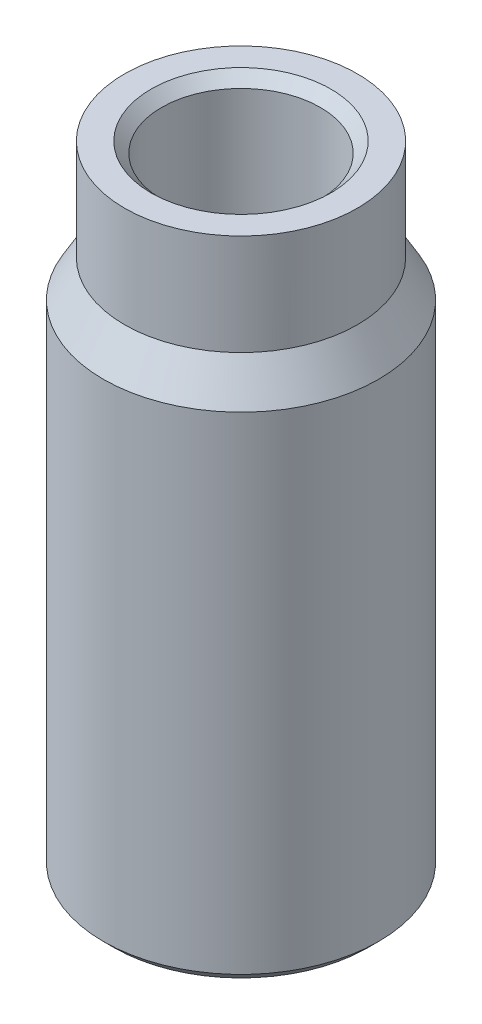
ISO-10303-21;
HEADER;
FILE_DESCRIPTION(('STEP AP214'),'2;1');
FILE_NAME('part.step','',(''),(''),'','','');
FILE_SCHEMA(('AUTOMOTIVE_DESIGN { 1 0 10303 214 1 1 1 1 }'));
ENDSEC;
DATA;
#1=APPLICATION_CONTEXT('core data for automotive mechanical design processes');
#2=APPLICATION_PROTOCOL_DEFINITION('international standard','automotive_design',2000,#1);
#3=PRODUCT_CONTEXT('',#1,'mechanical');
#4=PRODUCT('Part','Part','',(#3));
#5=PRODUCT_RELATED_PRODUCT_CATEGORY('part','',(#4));
#6=PRODUCT_DEFINITION_FORMATION('','',#4);
#7=PRODUCT_DEFINITION_CONTEXT('part definition',#1,'design');
#8=PRODUCT_DEFINITION('design','',#6,#7);
#9=PRODUCT_DEFINITION_SHAPE('','',#8);
#10=(LENGTH_UNIT() NAMED_UNIT(*) SI_UNIT(.MILLI.,.METRE.));
#11=(NAMED_UNIT(*) PLANE_ANGLE_UNIT() SI_UNIT($,.RADIAN.));
#12=(NAMED_UNIT(*) SI_UNIT($,.STERADIAN.) SOLID_ANGLE_UNIT());
#13=UNCERTAINTY_MEASURE_WITH_UNIT(LENGTH_MEASURE(1.E-05),#10,'distance_accuracy_value','');
#14=(GEOMETRIC_REPRESENTATION_CONTEXT(3) GLOBAL_UNCERTAINTY_ASSIGNED_CONTEXT((#13)) GLOBAL_UNIT_ASSIGNED_CONTEXT((#10,
#11,#12)) REPRESENTATION_CONTEXT('',''));
#15=CARTESIAN_POINT('',(0.,0.,0.));
#16=DIRECTION('',(0.,0.,1.));
#17=DIRECTION('',(1.,0.,0.));
#18=AXIS2_PLACEMENT_3D('',#15,#16,#17);
#19=CARTESIAN_POINT('',(0.,0.,0.));
#20=DIRECTION('',(0.,1.,0.));
#21=DIRECTION('',(0.,0.,1.));
#22=AXIS2_PLACEMENT_3D('',#19,#20,#21);
#23=CYLINDRICAL_SURFACE('',#22,7.5);
#24=CARTESIAN_POINT('',(1.80411241501588E-13,59.0000301368725,0.));
#25=DIRECTION('',(0.,1.,0.));
#26=DIRECTION('',(0.,0.,1.));
#27=AXIS2_PLACEMENT_3D('',#24,#25,#26);
#28=CIRCLE('',#27,7.5);
#29=CARTESIAN_POINT('',(1.80411241501588E-13,59.0000301368725,7.5));
#30=VERTEX_POINT('',#29);
#31=EDGE_CURVE('E19',#30,#30,#28,.T.);
#32=ORIENTED_EDGE('',*,*,#31,.T.);
#33=EDGE_LOOP('',(#32));
#34=FACE_BOUND('',#33,.T.);
#35=CARTESIAN_POINT('',(0.,0.999969863077516,0.));
#36=DIRECTION('',(0.,-1.,0.));
#37=DIRECTION('',(0.,0.,-1.));
#38=AXIS2_PLACEMENT_3D('',#35,#36,#37);
#39=CIRCLE('',#38,7.5);
#40=CARTESIAN_POINT('',(0.,0.999969863077516,-7.5));
#41=VERTEX_POINT('',#40);
#42=EDGE_CURVE('E56',#41,#41,#39,.T.);
#43=ORIENTED_EDGE('',*,*,#42,.T.);
#44=EDGE_LOOP('',(#43));
#45=FACE_BOUND('',#44,.T.);
#46=ADVANCED_FACE('F16',(#34,#45),#23,.F.);
#47=CARTESIAN_POINT('',(1.80411241501588E-13,60.0000170774951,0.));
#48=DIRECTION('',(0.,1.,0.));
#49=DIRECTION('',(0.,0.,1.));
#50=AXIS2_PLACEMENT_3D('',#47,#48,#49);
#51=CONICAL_SURFACE('',#50,8.49998292243629,0.785396154274);
#52=ORIENTED_EDGE('',*,*,#31,.F.);
#53=EDGE_LOOP('',(#52));
#54=FACE_BOUND('',#53,.T.);
#55=CARTESIAN_POINT('',(1.80411241501588E-13,60.,0.));
#56=DIRECTION('',(0.,1.,0.));
#57=DIRECTION('',(0.,0.,1.));
#58=AXIS2_PLACEMENT_3D('',#55,#56,#57);
#59=CIRCLE('',#58,8.49996584500979);
#60=CARTESIAN_POINT('',(1.80411241501588E-13,60.,8.49996584500979));
#61=VERTEX_POINT('',#60);
#62=EDGE_CURVE('E54',#61,#61,#59,.F.);
#63=ORIENTED_EDGE('',*,*,#62,.F.);
#64=EDGE_LOOP('',(#63));
#65=FACE_BOUND('',#64,.T.);
#66=ADVANCED_FACE('F64',(#54,#65),#51,.F.);
#67=CARTESIAN_POINT('',(0.,-1.70775201063789E-05,0.));
#68=DIRECTION('',(0.,-1.,0.));
#69=DIRECTION('',(0.,0.,-1.));
#70=AXIS2_PLACEMENT_3D('',#67,#68,#69);
#71=CONICAL_SURFACE('',#70,8.49998292241128,0.785396154273999);
#72=ORIENTED_EDGE('',*,*,#42,.F.);
#73=EDGE_LOOP('',(#72));
#74=FACE_BOUND('',#73,.T.);
#75=CARTESIAN_POINT('',(0.,0.,0.));
#76=DIRECTION('',(0.,1.,0.));
#77=DIRECTION('',(0.,0.,1.));
#78=AXIS2_PLACEMENT_3D('',#75,#76,#77);
#79=CIRCLE('',#78,8.49996584495979);
#80=CARTESIAN_POINT('',(0.,0.,8.49996584495979));
#81=VERTEX_POINT('',#80);
#82=EDGE_CURVE('E37',#81,#81,#79,.F.);
#83=ORIENTED_EDGE('',*,*,#82,.T.);
#84=EDGE_LOOP('',(#83));
#85=FACE_BOUND('',#84,.T.);
#86=ADVANCED_FACE('F67',(#74,#85),#71,.F.);
#87=CARTESIAN_POINT('',(2.22044604925031E-13,60.,0.));
#88=DIRECTION('',(0.,1.,0.));
#89=DIRECTION('',(0.,0.,1.));
#90=AXIS2_PLACEMENT_3D('',#87,#88,#89);
#91=PLANE('',#90);
#92=ORIENTED_EDGE('',*,*,#62,.T.);
#93=EDGE_LOOP('',(#92));
#94=FACE_BOUND('',#93,.T.);
#95=CARTESIAN_POINT('',(2.22044604925031E-13,60.,0.));
#96=DIRECTION('',(0.,1.,0.));
#97=DIRECTION('',(0.,0.,1.));
#98=AXIS2_PLACEMENT_3D('',#95,#96,#97);
#99=CIRCLE('',#98,11.);
#100=CARTESIAN_POINT('',(2.22044604925031E-13,60.,11.));
#101=VERTEX_POINT('',#100);
#102=EDGE_CURVE('E36',#101,#101,#99,.F.);
#103=ORIENTED_EDGE('',*,*,#102,.F.);
#104=EDGE_LOOP('',(#103));
#105=FACE_BOUND('',#104,.T.);
#106=ADVANCED_FACE('F70',(#94,#105),#91,.T.);
#107=CARTESIAN_POINT('',(0.,0.,0.));
#108=DIRECTION('',(0.,1.,0.));
#109=DIRECTION('',(0.,0.,1.));
#110=AXIS2_PLACEMENT_3D('',#107,#108,#109);
#111=PLANE('',#110);
#112=ORIENTED_EDGE('',*,*,#82,.F.);
#113=EDGE_LOOP('',(#112));
#114=FACE_BOUND('',#113,.T.);
#115=CARTESIAN_POINT('',(0.,0.,0.));
#116=DIRECTION('',(0.,1.,0.));
#117=DIRECTION('',(0.,0.,1.));
#118=AXIS2_PLACEMENT_3D('',#115,#116,#117);
#119=CIRCLE('',#118,12.0000043175497);
#120=CARTESIAN_POINT('',(0.,0.,12.0000043175497));
#121=VERTEX_POINT('',#120);
#122=EDGE_CURVE('E40',#121,#121,#119,.T.);
#123=ORIENTED_EDGE('',*,*,#122,.F.);
#124=EDGE_LOOP('',(#123));
#125=FACE_BOUND('',#124,.T.);
#126=ADVANCED_FACE('F73',(#114,#125),#111,.F.);
#127=CARTESIAN_POINT('',(2.22044604925031E-13,47.,0.));
#128=DIRECTION('',(0.,1.,0.));
#129=DIRECTION('',(0.,0.,1.));
#130=AXIS2_PLACEMENT_3D('',#127,#128,#129);
#131=CYLINDRICAL_SURFACE('',#130,11.);
#132=ORIENTED_EDGE('',*,*,#102,.T.);
#133=EDGE_LOOP('',(#132));
#134=FACE_BOUND('',#133,.T.);
#135=CARTESIAN_POINT('',(2.22044604925031E-13,50.4641128945811,0.));
#136=DIRECTION('',(0.,-1.,0.));
#137=DIRECTION('',(1.,0.,0.));
#138=AXIS2_PLACEMENT_3D('',#135,#136,#137);
#139=CIRCLE('',#138,11.);
#140=CARTESIAN_POINT('',(-11.0000024419448,50.4641030252702,-1.45088330238963E-07));
#141=VERTEX_POINT('',#140);
#142=CARTESIAN_POINT('',(11.0000024419453,50.4641030252702,0.));
#143=VERTEX_POINT('',#142);
#144=EDGE_CURVE('E35',#141,#143,#139,.T.);
#145=ORIENTED_EDGE('',*,*,#144,.F.);
#146=CARTESIAN_POINT('',(2.22044604925031E-13,50.4641044349728,0.));
#147=DIRECTION('',(0.,-1.,0.));
#148=DIRECTION('',(-1.17926266462E-09,0.,-1.));
#149=AXIS2_PLACEMENT_3D('',#146,#147,#148);
#150=CIRCLE('',#149,11.00000488416);
#151=EDGE_CURVE('E31',#143,#141,#150,.T.);
#152=ORIENTED_EDGE('',*,*,#151,.F.);
#153=EDGE_LOOP('',(#145,#152));
#154=FACE_BOUND('',#153,.T.);
#155=ADVANCED_FACE('F34',(#134,#154),#131,.T.);
#156=CARTESIAN_POINT('',(0.,0.999997661328564,0.));
#157=DIRECTION('',(0.,1.,0.));
#158=DIRECTION('',(0.,0.,1.));
#159=AXIS2_PLACEMENT_3D('',#156,#157,#158);
#160=CONICAL_SURFACE('',#159,13.0000023386706,0.785398343294);
#161=CARTESIAN_POINT('',(0.,0.999997660921001,0.));
#162=DIRECTION('',(0.,1.,0.));
#163=DIRECTION('',(0.,0.,1.));
#164=AXIS2_PLACEMENT_3D('',#161,#162,#163);
#165=CIRCLE('',#164,13.);
#166=CARTESIAN_POINT('',(0.,0.999997660921001,13.));
#167=VERTEX_POINT('',#166);
#168=EDGE_CURVE('E25',#167,#167,#165,.T.);
#169=ORIENTED_EDGE('',*,*,#168,.F.);
#170=EDGE_LOOP('',(#169));
#171=FACE_BOUND('',#170,.T.);
#172=ORIENTED_EDGE('',*,*,#122,.T.);
#173=EDGE_LOOP('',(#172));
#174=FACE_BOUND('',#173,.T.);
#175=ADVANCED_FACE('F78',(#171,#174),#160,.T.);
#176=CARTESIAN_POINT('',(2.22044604925031E-13,47.000003332567,0.));
#177=DIRECTION('',(0.,-1.,0.));
#178=DIRECTION('',(1.,0.,0.));
#179=AXIS2_PLACEMENT_3D('',#176,#177,#178);
#180=CONICAL_SURFACE('',#179,13.0000057721719,0.52359903195);
#181=CARTESIAN_POINT('',(2.22044604925031E-13,47.000013330256,0.));
#182=DIRECTION('',(0.,-1.,0.));
#183=DIRECTION('',(1.,0.,0.));
#184=AXIS2_PLACEMENT_3D('',#181,#182,#183);
#185=CIRCLE('',#184,13.);
#186=CARTESIAN_POINT('',(13.0000000000002,47.000013330256,0.));
#187=VERTEX_POINT('',#186);
#188=EDGE_CURVE('E11',#187,#187,#185,.T.);
#189=ORIENTED_EDGE('',*,*,#188,.F.);
#190=EDGE_LOOP('',(#189));
#191=FACE_BOUND('',#190,.T.);
#192=ORIENTED_EDGE('',*,*,#144,.T.);
#193=ORIENTED_EDGE('',*,*,#151,.T.);
#194=EDGE_LOOP('',(#192,#193));
#195=FACE_BOUND('',#194,.T.);
#196=ADVANCED_FACE('F39',(#191,#195),#180,.T.);
#197=CARTESIAN_POINT('',(0.,0.,0.));
#198=DIRECTION('',(0.,1.,0.));
#199=DIRECTION('',(0.,0.,1.));
#200=AXIS2_PLACEMENT_3D('',#197,#198,#199);
#201=CYLINDRICAL_SURFACE('',#200,13.);
#202=ORIENTED_EDGE('',*,*,#168,.T.);
#203=EDGE_LOOP('',(#202));
#204=FACE_BOUND('',#203,.T.);
#205=ORIENTED_EDGE('',*,*,#188,.T.);
#206=EDGE_LOOP('',(#205));
#207=FACE_BOUND('',#206,.T.);
#208=ADVANCED_FACE('F89',(#204,#207),#201,.T.);
#209=CLOSED_SHELL('',(#46,#66,#86,#106,#126,#155,#175,#196,#208));
#210=MANIFOLD_SOLID_BREP('B1',#209);
#211=ADVANCED_BREP_SHAPE_REPRESENTATION('',(#18,#210),#14);
#212=SHAPE_DEFINITION_REPRESENTATION(#9,#211);
ENDSEC;
END-ISO-10303-21;
